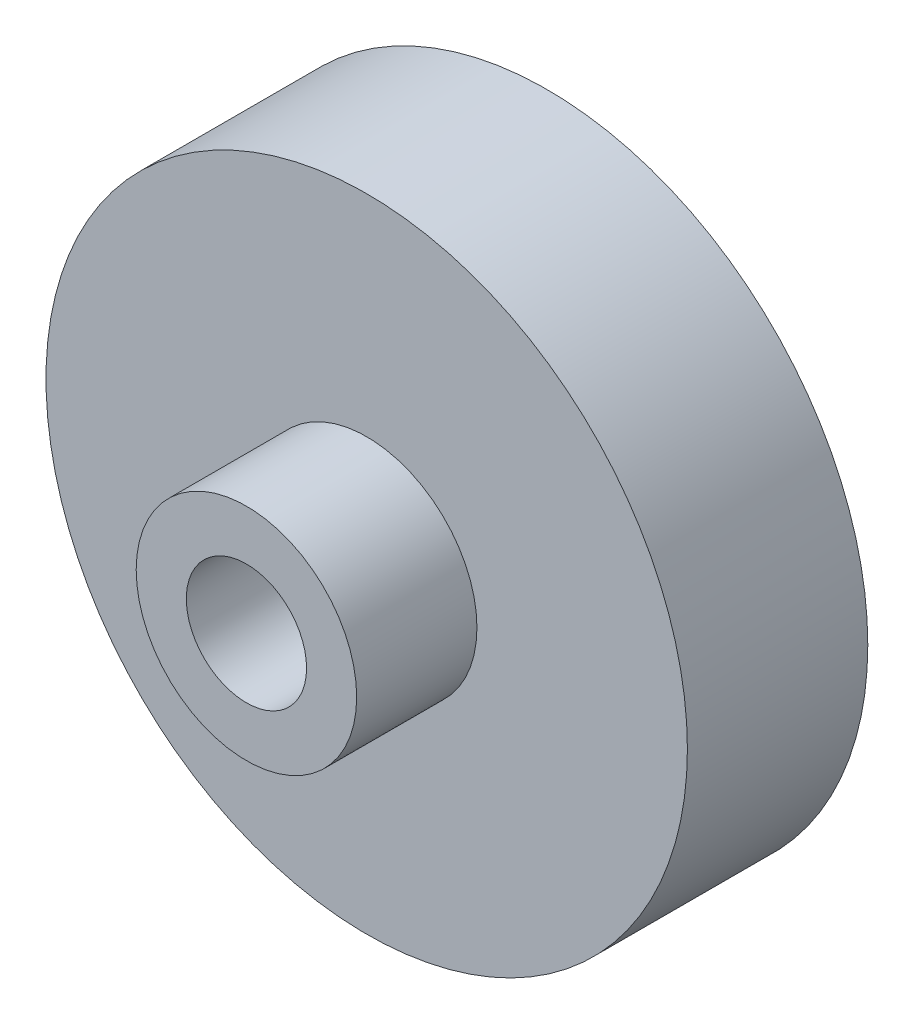
ISO-10303-21;
HEADER;
FILE_DESCRIPTION(('STEP AP214'),'2;1');
FILE_NAME('part.step','',(''),(''),'','','');
FILE_SCHEMA(('AUTOMOTIVE_DESIGN { 1 0 10303 214 1 1 1 1 }'));
ENDSEC;
DATA;
#1=APPLICATION_CONTEXT('core data for automotive mechanical design processes');
#2=APPLICATION_PROTOCOL_DEFINITION('international standard','automotive_design',2000,#1);
#3=PRODUCT_CONTEXT('',#1,'mechanical');
#4=PRODUCT('Part','Part','',(#3));
#5=PRODUCT_RELATED_PRODUCT_CATEGORY('part','',(#4));
#6=PRODUCT_DEFINITION_FORMATION('','',#4);
#7=PRODUCT_DEFINITION_CONTEXT('part definition',#1,'design');
#8=PRODUCT_DEFINITION('design','',#6,#7);
#9=PRODUCT_DEFINITION_SHAPE('','',#8);
#10=(LENGTH_UNIT() NAMED_UNIT(*) SI_UNIT(.MILLI.,.METRE.));
#11=(NAMED_UNIT(*) PLANE_ANGLE_UNIT() SI_UNIT($,.RADIAN.));
#12=(NAMED_UNIT(*) SI_UNIT($,.STERADIAN.) SOLID_ANGLE_UNIT());
#13=UNCERTAINTY_MEASURE_WITH_UNIT(LENGTH_MEASURE(1.E-05),#10,'distance_accuracy_value','');
#14=(GEOMETRIC_REPRESENTATION_CONTEXT(3) GLOBAL_UNCERTAINTY_ASSIGNED_CONTEXT((#13)) GLOBAL_UNIT_ASSIGNED_CONTEXT((#10,
#11,#12)) REPRESENTATION_CONTEXT('',''));
#15=CARTESIAN_POINT('',(0.,0.,0.));
#16=DIRECTION('',(0.,0.,1.));
#17=DIRECTION('',(1.,0.,0.));
#18=AXIS2_PLACEMENT_3D('',#15,#16,#17);
#19=CARTESIAN_POINT('',(0.,0.,9.));
#20=DIRECTION('',(0.,0.,-1.));
#21=DIRECTION('',(-1.,0.,0.));
#22=AXIS2_PLACEMENT_3D('',#19,#20,#21);
#23=CYLINDRICAL_SURFACE('',#22,16.);
#24=CARTESIAN_POINT('',(0.,0.,9.));
#25=DIRECTION('',(0.,0.,1.));
#26=DIRECTION('',(1.,0.,0.));
#27=AXIS2_PLACEMENT_3D('',#24,#25,#26);
#28=CIRCLE('',#27,16.);
#29=CARTESIAN_POINT('',(16.,0.,9.));
#30=VERTEX_POINT('',#29);
#31=EDGE_CURVE('E10',#30,#30,#28,.T.);
#32=ORIENTED_EDGE('',*,*,#31,.F.);
#33=EDGE_LOOP('',(#32));
#34=FACE_BOUND('',#33,.T.);
#35=CARTESIAN_POINT('',(0.,0.,0.));
#36=DIRECTION('',(0.,0.,1.));
#37=DIRECTION('',(1.,0.,0.));
#38=AXIS2_PLACEMENT_3D('',#35,#36,#37);
#39=CIRCLE('',#38,16.);
#40=CARTESIAN_POINT('',(16.,0.,0.));
#41=VERTEX_POINT('',#40);
#42=EDGE_CURVE('E39',#41,#41,#39,.T.);
#43=ORIENTED_EDGE('',*,*,#42,.T.);
#44=EDGE_LOOP('',(#43));
#45=FACE_BOUND('',#44,.T.);
#46=ADVANCED_FACE('F36',(#34,#45),#23,.T.);
#47=CARTESIAN_POINT('',(0.,0.,9.));
#48=DIRECTION('',(0.,0.,1.));
#49=DIRECTION('',(1.,0.,0.));
#50=AXIS2_PLACEMENT_3D('',#47,#48,#49);
#51=PLANE('',#50);
#52=ORIENTED_EDGE('',*,*,#31,.T.);
#53=EDGE_LOOP('',(#52));
#54=FACE_BOUND('',#53,.T.);
#55=CARTESIAN_POINT('',(0.,0.,9.));
#56=DIRECTION('',(0.,0.,1.));
#57=DIRECTION('',(1.,0.,0.));
#58=AXIS2_PLACEMENT_3D('',#55,#56,#57);
#59=CIRCLE('',#58,5.5);
#60=CARTESIAN_POINT('',(5.5,0.,9.));
#61=VERTEX_POINT('',#60);
#62=EDGE_CURVE('E61',#61,#61,#59,.T.);
#63=ORIENTED_EDGE('',*,*,#62,.F.);
#64=EDGE_LOOP('',(#63));
#65=FACE_BOUND('',#64,.T.);
#66=ADVANCED_FACE('F80',(#54,#65),#51,.T.);
#67=CARTESIAN_POINT('',(0.,0.,0.));
#68=DIRECTION('',(0.,0.,1.));
#69=DIRECTION('',(1.,0.,0.));
#70=AXIS2_PLACEMENT_3D('',#67,#68,#69);
#71=PLANE('',#70);
#72=CARTESIAN_POINT('',(-8.66025403784438,5.00000000000001,0.));
#73=DIRECTION('',(0.,0.,-1.));
#74=DIRECTION('',(-1.,0.,0.));
#75=AXIS2_PLACEMENT_3D('',#72,#73,#74);
#76=CIRCLE('',#75,0.6);
#77=CARTESIAN_POINT('',(-9.26025403784438,5.00000000000001,0.));
#78=VERTEX_POINT('',#77);
#79=EDGE_CURVE('E70',#78,#78,#76,.T.);
#80=ORIENTED_EDGE('',*,*,#79,.F.);
#81=EDGE_LOOP('',(#80));
#82=FACE_BOUND('',#81,.T.);
#83=CARTESIAN_POINT('',(8.66025403784442,4.99999999999995,0.));
#84=DIRECTION('',(0.,0.,-1.));
#85=DIRECTION('',(-1.,0.,0.));
#86=AXIS2_PLACEMENT_3D('',#83,#84,#85);
#87=CIRCLE('',#86,0.6);
#88=CARTESIAN_POINT('',(8.06025403784442,4.99999999999995,0.));
#89=VERTEX_POINT('',#88);
#90=EDGE_CURVE('E64',#89,#89,#87,.T.);
#91=ORIENTED_EDGE('',*,*,#90,.F.);
#92=EDGE_LOOP('',(#91));
#93=FACE_BOUND('',#92,.T.);
#94=CARTESIAN_POINT('',(0.,-10.,0.));
#95=DIRECTION('',(0.,0.,-1.));
#96=DIRECTION('',(-1.,0.,0.));
#97=AXIS2_PLACEMENT_3D('',#94,#95,#96);
#98=CIRCLE('',#97,0.6);
#99=CARTESIAN_POINT('',(-0.6,-10.,0.));
#100=VERTEX_POINT('',#99);
#101=EDGE_CURVE('E57',#100,#100,#98,.T.);
#102=ORIENTED_EDGE('',*,*,#101,.F.);
#103=EDGE_LOOP('',(#102));
#104=FACE_BOUND('',#103,.T.);
#105=CARTESIAN_POINT('',(0.,0.,0.));
#106=DIRECTION('',(0.,0.,1.));
#107=DIRECTION('',(1.,0.,0.));
#108=AXIS2_PLACEMENT_3D('',#105,#106,#107);
#109=CIRCLE('',#108,3.);
#110=CARTESIAN_POINT('',(3.,0.,0.));
#111=VERTEX_POINT('',#110);
#112=EDGE_CURVE('E50',#111,#111,#109,.T.);
#113=ORIENTED_EDGE('',*,*,#112,.T.);
#114=EDGE_LOOP('',(#113));
#115=FACE_BOUND('',#114,.T.);
#116=ORIENTED_EDGE('',*,*,#42,.F.);
#117=EDGE_LOOP('',(#116));
#118=FACE_BOUND('',#117,.T.);
#119=ADVANCED_FACE('F82',(#82,#93,#104,#115,#118),#71,.F.);
#120=CARTESIAN_POINT('',(0.,0.,15.));
#121=DIRECTION('',(0.,0.,-1.));
#122=DIRECTION('',(-1.,0.,0.));
#123=AXIS2_PLACEMENT_3D('',#120,#121,#122);
#124=CYLINDRICAL_SURFACE('',#123,5.5);
#125=CARTESIAN_POINT('',(0.,0.,15.));
#126=DIRECTION('',(0.,0.,1.));
#127=DIRECTION('',(1.,0.,0.));
#128=AXIS2_PLACEMENT_3D('',#125,#126,#127);
#129=CIRCLE('',#128,5.5);
#130=CARTESIAN_POINT('',(5.5,0.,15.));
#131=VERTEX_POINT('',#130);
#132=EDGE_CURVE('E46',#131,#131,#129,.T.);
#133=ORIENTED_EDGE('',*,*,#132,.F.);
#134=EDGE_LOOP('',(#133));
#135=FACE_BOUND('',#134,.T.);
#136=ORIENTED_EDGE('',*,*,#62,.T.);
#137=EDGE_LOOP('',(#136));
#138=FACE_BOUND('',#137,.T.);
#139=ADVANCED_FACE('F78',(#135,#138),#124,.T.);
#140=CARTESIAN_POINT('',(0.,0.,15.));
#141=DIRECTION('',(0.,0.,1.));
#142=DIRECTION('',(1.,0.,0.));
#143=AXIS2_PLACEMENT_3D('',#140,#141,#142);
#144=PLANE('',#143);
#145=CARTESIAN_POINT('',(0.,0.,15.));
#146=DIRECTION('',(0.,0.,1.));
#147=DIRECTION('',(1.,0.,0.));
#148=AXIS2_PLACEMENT_3D('',#145,#146,#147);
#149=CIRCLE('',#148,3.);
#150=CARTESIAN_POINT('',(3.,0.,15.));
#151=VERTEX_POINT('',#150);
#152=EDGE_CURVE('E53',#151,#151,#149,.T.);
#153=ORIENTED_EDGE('',*,*,#152,.F.);
#154=EDGE_LOOP('',(#153));
#155=FACE_BOUND('',#154,.T.);
#156=ORIENTED_EDGE('',*,*,#132,.T.);
#157=EDGE_LOOP('',(#156));
#158=FACE_BOUND('',#157,.T.);
#159=ADVANCED_FACE('F93',(#155,#158),#144,.T.);
#160=CARTESIAN_POINT('',(0.,0.,-11.25));
#161=DIRECTION('',(0.,0.,1.));
#162=DIRECTION('',(1.,0.,0.));
#163=AXIS2_PLACEMENT_3D('',#160,#161,#162);
#164=CYLINDRICAL_SURFACE('',#163,3.);
#165=ORIENTED_EDGE('',*,*,#152,.T.);
#166=EDGE_LOOP('',(#165));
#167=FACE_BOUND('',#166,.T.);
#168=ORIENTED_EDGE('',*,*,#112,.F.);
#169=EDGE_LOOP('',(#168));
#170=FACE_BOUND('',#169,.T.);
#171=ADVANCED_FACE('F97',(#167,#170),#164,.F.);
#172=CARTESIAN_POINT('',(0.,-10.,6.));
#173=DIRECTION('',(0.,0.,-1.));
#174=DIRECTION('',(-1.,0.,0.));
#175=AXIS2_PLACEMENT_3D('',#172,#173,#174);
#176=CYLINDRICAL_SURFACE('',#175,0.6);
#177=CARTESIAN_POINT('',(0.,-10.,6.));
#178=DIRECTION('',(0.,0.,-1.));
#179=DIRECTION('',(-1.,0.,0.));
#180=AXIS2_PLACEMENT_3D('',#177,#178,#179);
#181=CIRCLE('',#180,0.6);
#182=CARTESIAN_POINT('',(-0.6,-10.,6.));
#183=VERTEX_POINT('',#182);
#184=EDGE_CURVE('E60',#183,#183,#181,.T.);
#185=ORIENTED_EDGE('',*,*,#184,.F.);
#186=EDGE_LOOP('',(#185));
#187=FACE_BOUND('',#186,.T.);
#188=ORIENTED_EDGE('',*,*,#101,.T.);
#189=EDGE_LOOP('',(#188));
#190=FACE_BOUND('',#189,.T.);
#191=ADVANCED_FACE('F101',(#187,#190),#176,.F.);
#192=CARTESIAN_POINT('',(0.,-10.,6.));
#193=DIRECTION('',(0.,0.,-1.));
#194=DIRECTION('',(-1.,0.,0.));
#195=AXIS2_PLACEMENT_3D('',#192,#193,#194);
#196=PLANE('',#195);
#197=ORIENTED_EDGE('',*,*,#184,.T.);
#198=EDGE_LOOP('',(#197));
#199=FACE_BOUND('',#198,.T.);
#200=ADVANCED_FACE('F105',(#199),#196,.T.);
#201=CARTESIAN_POINT('',(8.66025403784442,4.99999999999995,6.));
#202=DIRECTION('',(0.,0.,-1.));
#203=DIRECTION('',(-1.,0.,0.));
#204=AXIS2_PLACEMENT_3D('',#201,#202,#203);
#205=CYLINDRICAL_SURFACE('',#204,0.6);
#206=CARTESIAN_POINT('',(8.66025403784442,4.99999999999995,6.));
#207=DIRECTION('',(0.,0.,-1.));
#208=DIRECTION('',(-1.,0.,0.));
#209=AXIS2_PLACEMENT_3D('',#206,#207,#208);
#210=CIRCLE('',#209,0.6);
#211=CARTESIAN_POINT('',(8.06025403784442,4.99999999999995,6.));
#212=VERTEX_POINT('',#211);
#213=EDGE_CURVE('E67',#212,#212,#210,.T.);
#214=ORIENTED_EDGE('',*,*,#213,.F.);
#215=EDGE_LOOP('',(#214));
#216=FACE_BOUND('',#215,.T.);
#217=ORIENTED_EDGE('',*,*,#90,.T.);
#218=EDGE_LOOP('',(#217));
#219=FACE_BOUND('',#218,.T.);
#220=ADVANCED_FACE('F109',(#216,#219),#205,.F.);
#221=CARTESIAN_POINT('',(8.66025403784442,4.99999999999995,6.));
#222=DIRECTION('',(0.,0.,-1.));
#223=DIRECTION('',(-1.,0.,0.));
#224=AXIS2_PLACEMENT_3D('',#221,#222,#223);
#225=PLANE('',#224);
#226=ORIENTED_EDGE('',*,*,#213,.T.);
#227=EDGE_LOOP('',(#226));
#228=FACE_BOUND('',#227,.T.);
#229=ADVANCED_FACE('F113',(#228),#225,.T.);
#230=CARTESIAN_POINT('',(-8.66025403784438,5.00000000000001,6.));
#231=DIRECTION('',(0.,0.,-1.));
#232=DIRECTION('',(-1.,0.,0.));
#233=AXIS2_PLACEMENT_3D('',#230,#231,#232);
#234=CYLINDRICAL_SURFACE('',#233,0.6);
#235=CARTESIAN_POINT('',(-8.66025403784438,5.00000000000001,6.));
#236=DIRECTION('',(0.,0.,-1.));
#237=DIRECTION('',(-1.,0.,0.));
#238=AXIS2_PLACEMENT_3D('',#235,#236,#237);
#239=CIRCLE('',#238,0.6);
#240=CARTESIAN_POINT('',(-9.26025403784438,5.00000000000001,6.));
#241=VERTEX_POINT('',#240);
#242=EDGE_CURVE('E56',#241,#241,#239,.T.);
#243=ORIENTED_EDGE('',*,*,#242,.F.);
#244=EDGE_LOOP('',(#243));
#245=FACE_BOUND('',#244,.T.);
#246=ORIENTED_EDGE('',*,*,#79,.T.);
#247=EDGE_LOOP('',(#246));
#248=FACE_BOUND('',#247,.T.);
#249=ADVANCED_FACE('F117',(#245,#248),#234,.F.);
#250=CARTESIAN_POINT('',(-8.66025403784438,5.00000000000001,6.));
#251=DIRECTION('',(0.,0.,-1.));
#252=DIRECTION('',(-1.,0.,0.));
#253=AXIS2_PLACEMENT_3D('',#250,#251,#252);
#254=PLANE('',#253);
#255=ORIENTED_EDGE('',*,*,#242,.T.);
#256=EDGE_LOOP('',(#255));
#257=FACE_BOUND('',#256,.T.);
#258=ADVANCED_FACE('F121',(#257),#254,.T.);
#259=CLOSED_SHELL('',(#46,#66,#119,#139,#159,#171,#191,#200,#220,#229,#249,#258));
#260=MANIFOLD_SOLID_BREP('B2',#259);
#261=ADVANCED_BREP_SHAPE_REPRESENTATION('',(#18,#260),#14);
#262=SHAPE_DEFINITION_REPRESENTATION(#9,#261);
ENDSEC;
END-ISO-10303-21;
